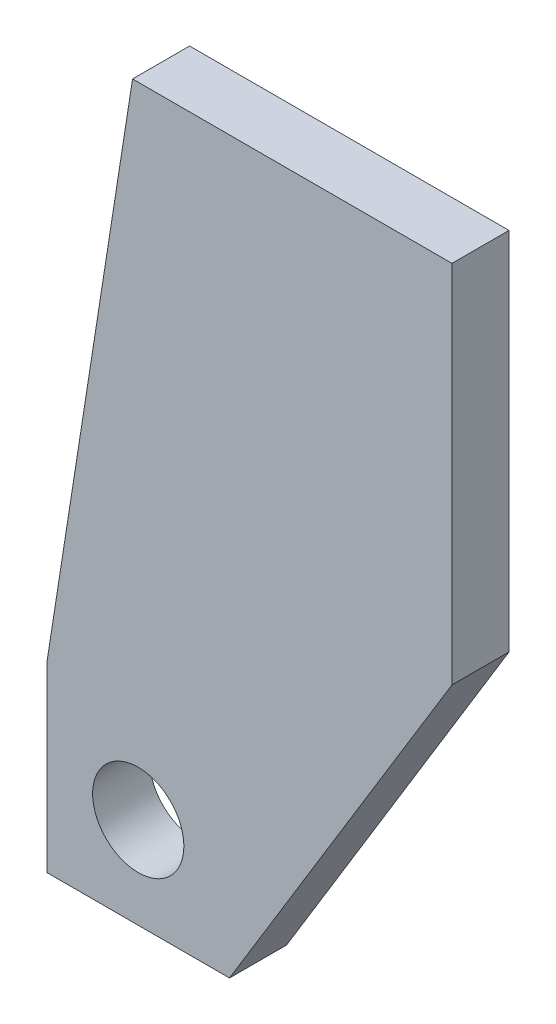
ISO-10303-21;
HEADER;
FILE_DESCRIPTION(('STEP AP214'),'2;1');
FILE_NAME('part.step','',(''),(''),'','','');
FILE_SCHEMA(('AUTOMOTIVE_DESIGN { 1 0 10303 214 1 1 1 1 }'));
ENDSEC;
DATA;
#1=APPLICATION_CONTEXT('core data for automotive mechanical design processes');
#2=APPLICATION_PROTOCOL_DEFINITION('international standard','automotive_design',2000,#1);
#3=PRODUCT_CONTEXT('',#1,'mechanical');
#4=PRODUCT('Part','Part','',(#3));
#5=PRODUCT_RELATED_PRODUCT_CATEGORY('part','',(#4));
#6=PRODUCT_DEFINITION_FORMATION('','',#4);
#7=PRODUCT_DEFINITION_CONTEXT('part definition',#1,'design');
#8=PRODUCT_DEFINITION('design','',#6,#7);
#9=PRODUCT_DEFINITION_SHAPE('','',#8);
#10=(LENGTH_UNIT() NAMED_UNIT(*) SI_UNIT(.MILLI.,.METRE.));
#11=(NAMED_UNIT(*) PLANE_ANGLE_UNIT() SI_UNIT($,.RADIAN.));
#12=(NAMED_UNIT(*) SI_UNIT($,.STERADIAN.) SOLID_ANGLE_UNIT());
#13=UNCERTAINTY_MEASURE_WITH_UNIT(LENGTH_MEASURE(1.E-05),#10,'distance_accuracy_value','');
#14=(GEOMETRIC_REPRESENTATION_CONTEXT(3) GLOBAL_UNCERTAINTY_ASSIGNED_CONTEXT((#13)) GLOBAL_UNIT_ASSIGNED_CONTEXT((#10,
#11,#12)) REPRESENTATION_CONTEXT('',''));
#15=CARTESIAN_POINT('',(0.,0.,0.));
#16=DIRECTION('',(0.,0.,1.));
#17=DIRECTION('',(1.,0.,0.));
#18=AXIS2_PLACEMENT_3D('',#15,#16,#17);
#19=CARTESIAN_POINT('',(0.,0.,25.));
#20=DIRECTION('',(0.,0.,1.));
#21=DIRECTION('',(1.,0.,0.));
#22=AXIS2_PLACEMENT_3D('',#19,#20,#21);
#23=PLANE('',#22);
#24=DIRECTION('',(0.,-1.,0.));
#25=VECTOR('',#24,1.);
#26=CARTESIAN_POINT('',(0.,38.,25.));
#27=LINE('',#26,#25);
#28=CARTESIAN_POINT('',(0.,38.,25.));
#29=VERTEX_POINT('',#28);
#30=CARTESIAN_POINT('',(0.,22.,25.));
#31=VERTEX_POINT('',#30);
#32=EDGE_CURVE('E127',#29,#31,#27,.T.);
#33=ORIENTED_EDGE('',*,*,#32,.T.);
#34=DIRECTION('',(1.,0.,0.));
#35=VECTOR('',#34,1.);
#36=CARTESIAN_POINT('',(0.,22.,25.));
#37=LINE('',#36,#35);
#38=CARTESIAN_POINT('',(16.,22.,25.));
#39=VERTEX_POINT('',#38);
#40=EDGE_CURVE('E85',#31,#39,#37,.T.);
#41=ORIENTED_EDGE('',*,*,#40,.T.);
#42=DIRECTION('',(0.520370172675462,0.853940796185374,0.));
#43=VECTOR('',#42,1.);
#44=CARTESIAN_POINT('',(16.,22.,25.));
#45=LINE('',#44,#43);
#46=CARTESIAN_POINT('',(35.5,54.,25.));
#47=VERTEX_POINT('',#46);
#48=EDGE_CURVE('E98',#39,#47,#45,.T.);
#49=ORIENTED_EDGE('',*,*,#48,.T.);
#50=DIRECTION('',(0.,1.,0.));
#51=VECTOR('',#50,1.);
#52=CARTESIAN_POINT('',(35.5,54.,25.));
#53=LINE('',#52,#51);
#54=CARTESIAN_POINT('',(35.5,86.,25.));
#55=VERTEX_POINT('',#54);
#56=EDGE_CURVE('E92',#47,#55,#53,.T.);
#57=ORIENTED_EDGE('',*,*,#56,.T.);
#58=DIRECTION('',(-1.,0.,0.));
#59=VECTOR('',#58,1.);
#60=CARTESIAN_POINT('',(35.5,86.,25.));
#61=LINE('',#60,#59);
#62=CARTESIAN_POINT('',(7.5,86.,25.));
#63=VERTEX_POINT('',#62);
#64=EDGE_CURVE('E96',#55,#63,#61,.T.);
#65=ORIENTED_EDGE('',*,*,#64,.T.);
#66=DIRECTION('',(-0.15437688027361,-0.988012033751101,0.));
#67=VECTOR('',#66,1.);
#68=CARTESIAN_POINT('',(7.5,86.,25.));
#69=LINE('',#68,#67);
#70=EDGE_CURVE('E48',#63,#29,#69,.T.);
#71=ORIENTED_EDGE('',*,*,#70,.T.);
#72=EDGE_LOOP('',(#33,#41,#49,#57,#65,#71));
#73=FACE_BOUND('',#72,.T.);
#74=CARTESIAN_POINT('',(7.99999999999999,30.,25.));
#75=DIRECTION('',(0.,0.,1.));
#76=DIRECTION('',(1.,0.,0.));
#77=AXIS2_PLACEMENT_3D('',#74,#75,#76);
#78=CIRCLE('',#77,4.00000000000001);
#79=CARTESIAN_POINT('',(12.,30.,25.));
#80=VERTEX_POINT('',#79);
#81=EDGE_CURVE('E120',#80,#80,#78,.T.);
#82=ORIENTED_EDGE('',*,*,#81,.F.);
#83=EDGE_LOOP('',(#82));
#84=FACE_BOUND('',#83,.T.);
#85=ADVANCED_FACE('F31',(#73,#84),#23,.T.);
#86=CARTESIAN_POINT('',(0.,0.,20.));
#87=DIRECTION('',(0.,0.,1.));
#88=DIRECTION('',(1.,0.,0.));
#89=AXIS2_PLACEMENT_3D('',#86,#87,#88);
#90=PLANE('',#89);
#91=DIRECTION('',(0.,-1.,0.));
#92=VECTOR('',#91,1.);
#93=CARTESIAN_POINT('',(0.,38.,20.));
#94=LINE('',#93,#92);
#95=CARTESIAN_POINT('',(0.,38.,20.));
#96=VERTEX_POINT('',#95);
#97=CARTESIAN_POINT('',(0.,22.,20.));
#98=VERTEX_POINT('',#97);
#99=EDGE_CURVE('E116',#96,#98,#94,.T.);
#100=ORIENTED_EDGE('',*,*,#99,.F.);
#101=DIRECTION('',(-0.15437688027361,-0.988012033751101,0.));
#102=VECTOR('',#101,1.);
#103=CARTESIAN_POINT('',(7.5,86.,20.));
#104=LINE('',#103,#102);
#105=CARTESIAN_POINT('',(7.5,86.,20.));
#106=VERTEX_POINT('',#105);
#107=EDGE_CURVE('E77',#106,#96,#104,.T.);
#108=ORIENTED_EDGE('',*,*,#107,.F.);
#109=DIRECTION('',(-1.,0.,0.));
#110=VECTOR('',#109,1.);
#111=CARTESIAN_POINT('',(35.5,86.,20.));
#112=LINE('',#111,#110);
#113=CARTESIAN_POINT('',(35.5,86.,20.));
#114=VERTEX_POINT('',#113);
#115=EDGE_CURVE('E71',#114,#106,#112,.T.);
#116=ORIENTED_EDGE('',*,*,#115,.F.);
#117=DIRECTION('',(0.,1.,0.));
#118=VECTOR('',#117,1.);
#119=CARTESIAN_POINT('',(35.5,54.,20.));
#120=LINE('',#119,#118);
#121=CARTESIAN_POINT('',(35.5,54.,20.));
#122=VERTEX_POINT('',#121);
#123=EDGE_CURVE('E106',#122,#114,#120,.T.);
#124=ORIENTED_EDGE('',*,*,#123,.F.);
#125=DIRECTION('',(0.520370172675462,0.853940796185374,0.));
#126=VECTOR('',#125,1.);
#127=CARTESIAN_POINT('',(16.,22.,20.));
#128=LINE('',#127,#126);
#129=CARTESIAN_POINT('',(16.,22.,20.));
#130=VERTEX_POINT('',#129);
#131=EDGE_CURVE('E122',#130,#122,#128,.T.);
#132=ORIENTED_EDGE('',*,*,#131,.F.);
#133=DIRECTION('',(1.,0.,0.));
#134=VECTOR('',#133,1.);
#135=CARTESIAN_POINT('',(0.,22.,20.));
#136=LINE('',#135,#134);
#137=EDGE_CURVE('E119',#98,#130,#136,.T.);
#138=ORIENTED_EDGE('',*,*,#137,.F.);
#139=EDGE_LOOP('',(#100,#108,#116,#124,#132,#138));
#140=FACE_BOUND('',#139,.T.);
#141=CARTESIAN_POINT('',(7.99999999999999,30.,20.));
#142=DIRECTION('',(0.,0.,1.));
#143=DIRECTION('',(1.,0.,0.));
#144=AXIS2_PLACEMENT_3D('',#141,#142,#143);
#145=CIRCLE('',#144,4.00000000000001);
#146=CARTESIAN_POINT('',(12.,30.,20.));
#147=VERTEX_POINT('',#146);
#148=EDGE_CURVE('E220',#147,#147,#145,.T.);
#149=ORIENTED_EDGE('',*,*,#148,.T.);
#150=EDGE_LOOP('',(#149));
#151=FACE_BOUND('',#150,.T.);
#152=ADVANCED_FACE('F136',(#140,#151),#90,.F.);
#153=CARTESIAN_POINT('',(0.,38.,25.));
#154=DIRECTION('',(1.,0.,0.));
#155=DIRECTION('',(0.,1.,0.));
#156=AXIS2_PLACEMENT_3D('',#153,#154,#155);
#157=PLANE('',#156);
#158=ORIENTED_EDGE('',*,*,#99,.T.);
#159=DIRECTION('',(0.,0.,-1.));
#160=VECTOR('',#159,1.);
#161=CARTESIAN_POINT('',(0.,22.,25.));
#162=LINE('',#161,#160);
#163=EDGE_CURVE('E11',#31,#98,#162,.T.);
#164=ORIENTED_EDGE('',*,*,#163,.F.);
#165=ORIENTED_EDGE('',*,*,#32,.F.);
#166=DIRECTION('',(0.,0.,-1.));
#167=VECTOR('',#166,1.);
#168=CARTESIAN_POINT('',(0.,38.,25.));
#169=LINE('',#168,#167);
#170=EDGE_CURVE('E112',#29,#96,#169,.T.);
#171=ORIENTED_EDGE('',*,*,#170,.T.);
#172=EDGE_LOOP('',(#158,#164,#165,#171));
#173=FACE_BOUND('',#172,.T.);
#174=ADVANCED_FACE('F33',(#173),#157,.F.);
#175=CARTESIAN_POINT('',(0.,22.,25.));
#176=DIRECTION('',(0.,1.,0.));
#177=DIRECTION('',(0.,0.,1.));
#178=AXIS2_PLACEMENT_3D('',#175,#176,#177);
#179=PLANE('',#178);
#180=ORIENTED_EDGE('',*,*,#137,.T.);
#181=DIRECTION('',(0.,0.,-1.));
#182=VECTOR('',#181,1.);
#183=CARTESIAN_POINT('',(16.,22.,25.));
#184=LINE('',#183,#182);
#185=EDGE_CURVE('E40',#39,#130,#184,.T.);
#186=ORIENTED_EDGE('',*,*,#185,.F.);
#187=ORIENTED_EDGE('',*,*,#40,.F.);
#188=ORIENTED_EDGE('',*,*,#163,.T.);
#189=EDGE_LOOP('',(#180,#186,#187,#188));
#190=FACE_BOUND('',#189,.T.);
#191=ADVANCED_FACE('F161',(#190),#179,.F.);
#192=CARTESIAN_POINT('',(16.,22.,25.));
#193=DIRECTION('',(-0.853940796185374,0.520370172675462,0.));
#194=DIRECTION('',(-0.520370172675462,-0.853940796185374,0.));
#195=AXIS2_PLACEMENT_3D('',#192,#193,#194);
#196=PLANE('',#195);
#197=ORIENTED_EDGE('',*,*,#131,.T.);
#198=DIRECTION('',(0.,0.,-1.));
#199=VECTOR('',#198,1.);
#200=CARTESIAN_POINT('',(35.5,54.,25.));
#201=LINE('',#200,#199);
#202=EDGE_CURVE('E107',#47,#122,#201,.T.);
#203=ORIENTED_EDGE('',*,*,#202,.F.);
#204=ORIENTED_EDGE('',*,*,#48,.F.);
#205=ORIENTED_EDGE('',*,*,#185,.T.);
#206=EDGE_LOOP('',(#197,#203,#204,#205));
#207=FACE_BOUND('',#206,.T.);
#208=ADVANCED_FACE('F133',(#207),#196,.F.);
#209=CARTESIAN_POINT('',(35.5,54.,25.));
#210=DIRECTION('',(-1.,0.,0.));
#211=DIRECTION('',(0.,-1.,0.));
#212=AXIS2_PLACEMENT_3D('',#209,#210,#211);
#213=PLANE('',#212);
#214=ORIENTED_EDGE('',*,*,#123,.T.);
#215=DIRECTION('',(0.,0.,-1.));
#216=VECTOR('',#215,1.);
#217=CARTESIAN_POINT('',(35.5,86.,25.));
#218=LINE('',#217,#216);
#219=EDGE_CURVE('E103',#55,#114,#218,.T.);
#220=ORIENTED_EDGE('',*,*,#219,.F.);
#221=ORIENTED_EDGE('',*,*,#56,.F.);
#222=ORIENTED_EDGE('',*,*,#202,.T.);
#223=EDGE_LOOP('',(#214,#220,#221,#222));
#224=FACE_BOUND('',#223,.T.);
#225=ADVANCED_FACE('F104',(#224),#213,.F.);
#226=CARTESIAN_POINT('',(35.5,86.,25.));
#227=DIRECTION('',(0.,-1.,0.));
#228=DIRECTION('',(1.,0.,0.));
#229=AXIS2_PLACEMENT_3D('',#226,#227,#228);
#230=PLANE('',#229);
#231=ORIENTED_EDGE('',*,*,#115,.T.);
#232=DIRECTION('',(0.,0.,-1.));
#233=VECTOR('',#232,1.);
#234=CARTESIAN_POINT('',(7.5,86.,25.));
#235=LINE('',#234,#233);
#236=EDGE_CURVE('E108',#63,#106,#235,.T.);
#237=ORIENTED_EDGE('',*,*,#236,.F.);
#238=ORIENTED_EDGE('',*,*,#64,.F.);
#239=ORIENTED_EDGE('',*,*,#219,.T.);
#240=EDGE_LOOP('',(#231,#237,#238,#239));
#241=FACE_BOUND('',#240,.T.);
#242=ADVANCED_FACE('F110',(#241),#230,.F.);
#243=CARTESIAN_POINT('',(7.5,86.,25.));
#244=DIRECTION('',(0.988012033751101,-0.15437688027361,0.));
#245=DIRECTION('',(0.15437688027361,0.988012033751101,0.));
#246=AXIS2_PLACEMENT_3D('',#243,#244,#245);
#247=PLANE('',#246);
#248=ORIENTED_EDGE('',*,*,#107,.T.);
#249=ORIENTED_EDGE('',*,*,#170,.F.);
#250=ORIENTED_EDGE('',*,*,#70,.F.);
#251=ORIENTED_EDGE('',*,*,#236,.T.);
#252=EDGE_LOOP('',(#248,#249,#250,#251));
#253=FACE_BOUND('',#252,.T.);
#254=ADVANCED_FACE('F141',(#253),#247,.F.);
#255=CARTESIAN_POINT('',(7.99999999999999,30.,25.));
#256=DIRECTION('',(0.,0.,-1.));
#257=DIRECTION('',(-1.,0.,0.));
#258=AXIS2_PLACEMENT_3D('',#255,#256,#257);
#259=CYLINDRICAL_SURFACE('',#258,4.00000000000001);
#260=ORIENTED_EDGE('',*,*,#81,.T.);
#261=EDGE_LOOP('',(#260));
#262=FACE_BOUND('',#261,.T.);
#263=ORIENTED_EDGE('',*,*,#148,.F.);
#264=EDGE_LOOP('',(#263));
#265=FACE_BOUND('',#264,.T.);
#266=ADVANCED_FACE('F143',(#262,#265),#259,.F.);
#267=CLOSED_SHELL('',(#85,#152,#174,#191,#208,#225,#242,#254,#266));
#268=MANIFOLD_SOLID_BREP('B2',#267);
#269=ADVANCED_BREP_SHAPE_REPRESENTATION('',(#18,#268),#14);
#270=SHAPE_DEFINITION_REPRESENTATION(#9,#269);
ENDSEC;
END-ISO-10303-21;
